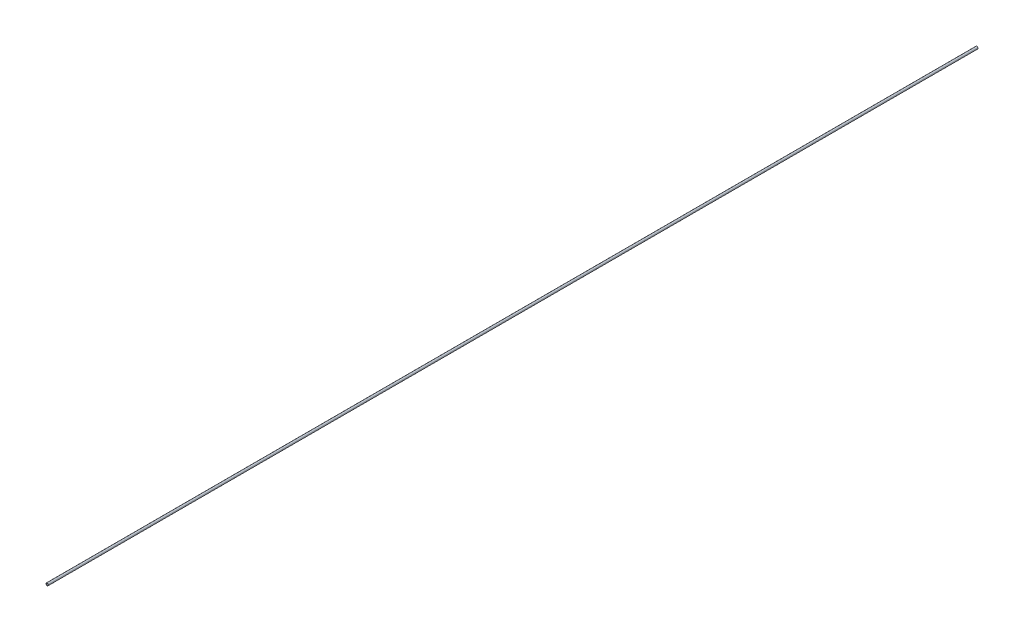
ISO-10303-21;
HEADER;
FILE_DESCRIPTION(('STEP AP214'),'2;1');
FILE_NAME('part.step','',(''),(''),'','','');
FILE_SCHEMA(('AUTOMOTIVE_DESIGN { 1 0 10303 214 1 1 1 1 }'));
ENDSEC;
DATA;
#1=APPLICATION_CONTEXT('core data for automotive mechanical design processes');
#2=APPLICATION_PROTOCOL_DEFINITION('international standard','automotive_design',2000,#1);
#3=PRODUCT_CONTEXT('',#1,'mechanical');
#4=PRODUCT('Part','Part','',(#3));
#5=PRODUCT_RELATED_PRODUCT_CATEGORY('part','',(#4));
#6=PRODUCT_DEFINITION_FORMATION('','',#4);
#7=PRODUCT_DEFINITION_CONTEXT('part definition',#1,'design');
#8=PRODUCT_DEFINITION('design','',#6,#7);
#9=PRODUCT_DEFINITION_SHAPE('','',#8);
#10=(LENGTH_UNIT() NAMED_UNIT(*) SI_UNIT(.MILLI.,.METRE.));
#11=(NAMED_UNIT(*) PLANE_ANGLE_UNIT() SI_UNIT($,.RADIAN.));
#12=(NAMED_UNIT(*) SI_UNIT($,.STERADIAN.) SOLID_ANGLE_UNIT());
#13=UNCERTAINTY_MEASURE_WITH_UNIT(LENGTH_MEASURE(1.E-05),#10,'distance_accuracy_value','');
#14=(GEOMETRIC_REPRESENTATION_CONTEXT(3) GLOBAL_UNCERTAINTY_ASSIGNED_CONTEXT((#13)) GLOBAL_UNIT_ASSIGNED_CONTEXT((#10,
#11,#12)) REPRESENTATION_CONTEXT('',''));
#15=CARTESIAN_POINT('',(0.,0.,0.));
#16=DIRECTION('',(0.,0.,1.));
#17=DIRECTION('',(1.,0.,0.));
#18=AXIS2_PLACEMENT_3D('',#15,#16,#17);
#19=CARTESIAN_POINT('',(0.,0.,0.));
#20=DIRECTION('',(0.,0.,1.));
#21=DIRECTION('',(1.,0.,0.));
#22=AXIS2_PLACEMENT_3D('',#19,#20,#21);
#23=PLANE('',#22);
#24=CARTESIAN_POINT('',(0.,0.,0.));
#25=DIRECTION('',(0.,0.,1.));
#26=DIRECTION('',(1.,0.,0.));
#27=AXIS2_PLACEMENT_3D('',#24,#25,#26);
#28=CIRCLE('',#27,2.5);
#29=CARTESIAN_POINT('',(2.5,0.,0.));
#30=VERTEX_POINT('',#29);
#31=EDGE_CURVE('E10',#30,#30,#28,.T.);
#32=ORIENTED_EDGE('',*,*,#31,.F.);
#33=EDGE_LOOP('',(#32));
#34=FACE_BOUND('',#33,.T.);
#35=CARTESIAN_POINT('',(0.,0.,0.));
#36=DIRECTION('',(0.,0.,1.));
#37=DIRECTION('',(1.,0.,0.));
#38=AXIS2_PLACEMENT_3D('',#35,#36,#37);
#39=CIRCLE('',#38,1.6);
#40=CARTESIAN_POINT('',(1.6,0.,0.));
#41=VERTEX_POINT('',#40);
#42=EDGE_CURVE('E38',#41,#41,#39,.T.);
#43=ORIENTED_EDGE('',*,*,#42,.T.);
#44=EDGE_LOOP('',(#43));
#45=FACE_BOUND('',#44,.T.);
#46=ADVANCED_FACE('F31',(#34,#45),#23,.F.);
#47=CARTESIAN_POINT('',(0.,0.,1000.));
#48=DIRECTION('',(0.,0.,-1.));
#49=DIRECTION('',(-1.,0.,0.));
#50=AXIS2_PLACEMENT_3D('',#47,#48,#49);
#51=CYLINDRICAL_SURFACE('',#50,2.5);
#52=ORIENTED_EDGE('',*,*,#31,.T.);
#53=EDGE_LOOP('',(#52));
#54=FACE_BOUND('',#53,.T.);
#55=CARTESIAN_POINT('',(0.,0.,2000.));
#56=DIRECTION('',(0.,0.,1.));
#57=DIRECTION('',(1.,0.,0.));
#58=AXIS2_PLACEMENT_3D('',#55,#56,#57);
#59=CIRCLE('',#58,2.5);
#60=CARTESIAN_POINT('',(2.5,0.,2000.));
#61=VERTEX_POINT('',#60);
#62=EDGE_CURVE('E42',#61,#61,#59,.T.);
#63=ORIENTED_EDGE('',*,*,#62,.F.);
#64=EDGE_LOOP('',(#63));
#65=FACE_BOUND('',#64,.T.);
#66=ADVANCED_FACE('F33',(#54,#65),#51,.T.);
#67=CARTESIAN_POINT('',(0.,0.,1000.));
#68=DIRECTION('',(0.,0.,-1.));
#69=DIRECTION('',(-1.,0.,0.));
#70=AXIS2_PLACEMENT_3D('',#67,#68,#69);
#71=CYLINDRICAL_SURFACE('',#70,1.6);
#72=ORIENTED_EDGE('',*,*,#42,.F.);
#73=EDGE_LOOP('',(#72));
#74=FACE_BOUND('',#73,.T.);
#75=CARTESIAN_POINT('',(0.,0.,2000.));
#76=DIRECTION('',(0.,0.,1.));
#77=DIRECTION('',(1.,0.,0.));
#78=AXIS2_PLACEMENT_3D('',#75,#76,#77);
#79=CIRCLE('',#78,1.6);
#80=CARTESIAN_POINT('',(1.6,0.,2000.));
#81=VERTEX_POINT('',#80);
#82=EDGE_CURVE('E46',#81,#81,#79,.T.);
#83=ORIENTED_EDGE('',*,*,#82,.T.);
#84=EDGE_LOOP('',(#83));
#85=FACE_BOUND('',#84,.T.);
#86=ADVANCED_FACE('F52',(#74,#85),#71,.F.);
#87=CARTESIAN_POINT('',(0.,0.,2000.));
#88=DIRECTION('',(0.,0.,1.));
#89=DIRECTION('',(1.,0.,0.));
#90=AXIS2_PLACEMENT_3D('',#87,#88,#89);
#91=PLANE('',#90);
#92=ORIENTED_EDGE('',*,*,#62,.T.);
#93=EDGE_LOOP('',(#92));
#94=FACE_BOUND('',#93,.T.);
#95=ORIENTED_EDGE('',*,*,#82,.F.);
#96=EDGE_LOOP('',(#95));
#97=FACE_BOUND('',#96,.T.);
#98=ADVANCED_FACE('F54',(#94,#97),#91,.T.);
#99=CLOSED_SHELL('',(#46,#66,#86,#98));
#100=MANIFOLD_SOLID_BREP('B2',#99);
#101=ADVANCED_BREP_SHAPE_REPRESENTATION('',(#18,#100),#14);
#102=SHAPE_DEFINITION_REPRESENTATION(#9,#101);
ENDSEC;
END-ISO-10303-21;
